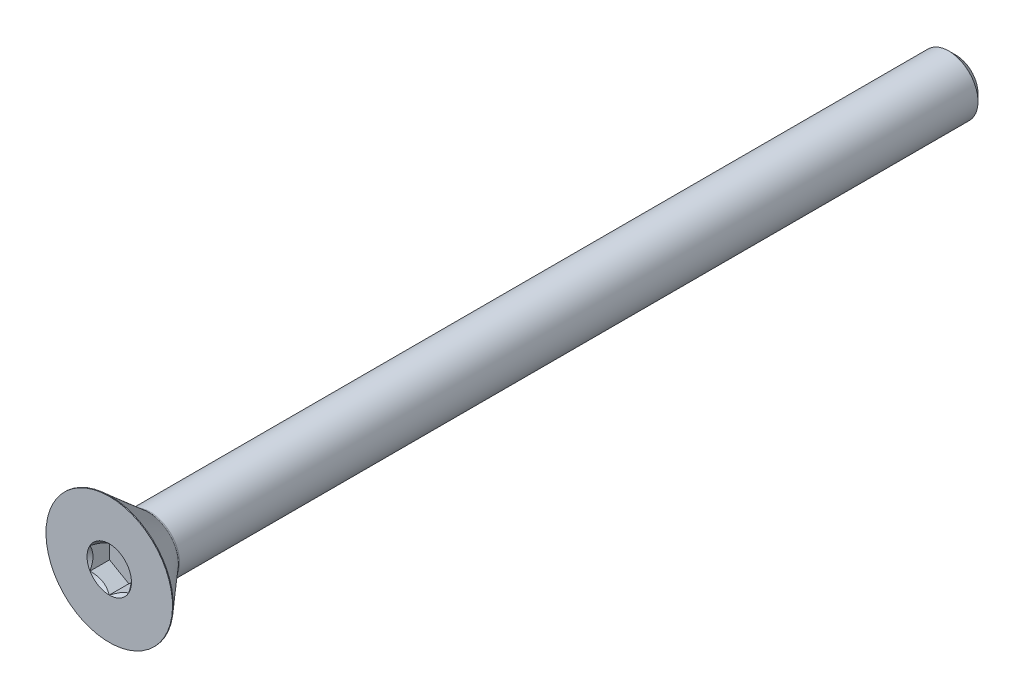
ISO-10303-21;
HEADER;
FILE_DESCRIPTION(('STEP AP214'),'2;1');
FILE_NAME('part.step','',(''),(''),'','','');
FILE_SCHEMA(('AUTOMOTIVE_DESIGN { 1 0 10303 214 1 1 1 1 }'));
ENDSEC;
DATA;
#1=APPLICATION_CONTEXT('core data for automotive mechanical design processes');
#2=APPLICATION_PROTOCOL_DEFINITION('international standard','automotive_design',2000,#1);
#3=PRODUCT_CONTEXT('',#1,'mechanical');
#4=PRODUCT('Part','Part','',(#3));
#5=PRODUCT_RELATED_PRODUCT_CATEGORY('part','',(#4));
#6=PRODUCT_DEFINITION_FORMATION('','',#4);
#7=PRODUCT_DEFINITION_CONTEXT('part definition',#1,'design');
#8=PRODUCT_DEFINITION('design','',#6,#7);
#9=PRODUCT_DEFINITION_SHAPE('','',#8);
#10=(LENGTH_UNIT() NAMED_UNIT(*) SI_UNIT(.MILLI.,.METRE.));
#11=(NAMED_UNIT(*) PLANE_ANGLE_UNIT() SI_UNIT($,.RADIAN.));
#12=(NAMED_UNIT(*) SI_UNIT($,.STERADIAN.) SOLID_ANGLE_UNIT());
#13=UNCERTAINTY_MEASURE_WITH_UNIT(LENGTH_MEASURE(1.E-05),#10,'distance_accuracy_value','');
#14=(GEOMETRIC_REPRESENTATION_CONTEXT(3) GLOBAL_UNCERTAINTY_ASSIGNED_CONTEXT((#13)) GLOBAL_UNIT_ASSIGNED_CONTEXT((#10,
#11,#12)) REPRESENTATION_CONTEXT('',''));
#15=CARTESIAN_POINT('',(0.,0.,0.));
#16=DIRECTION('',(0.,0.,1.));
#17=DIRECTION('',(1.,0.,0.));
#18=AXIS2_PLACEMENT_3D('',#15,#16,#17);
#19=CARTESIAN_POINT('',(0.,0.,34.925));
#20=DIRECTION('',(0.,0.,1.));
#21=DIRECTION('',(1.,0.,0.));
#22=AXIS2_PLACEMENT_3D('',#19,#20,#21);
#23=CONICAL_SURFACE('',#22,1.83308710467707,0.78539816339745);
#24=CARTESIAN_POINT('',(0.,0.,34.925));
#25=DIRECTION('',(0.,0.,1.));
#26=DIRECTION('',(1.,0.,0.));
#27=AXIS2_PLACEMENT_3D('',#24,#25,#26);
#28=CIRCLE('',#27,1.83308710467707);
#29=CARTESIAN_POINT('',(0.,-1.83308710467706,34.925));
#30=VERTEX_POINT('',#29);
#31=CARTESIAN_POINT('',(1.5875,-0.916543552338538,34.925));
#32=VERTEX_POINT('',#31);
#33=EDGE_CURVE('E257',#30,#32,#28,.T.);
#34=ORIENTED_EDGE('',*,*,#33,.T.);
#35=CARTESIAN_POINT('',(1.5877,-0.916428082284691,34.9251154809637));
#36=CARTESIAN_POINT('',(1.53312479190086,-0.947937093371808,34.8936308083706));
#37=CARTESIAN_POINT('',(1.47763696320971,-0.979973006203393,34.8639950460135));
#38=CARTESIAN_POINT('',(1.36449087915364,-1.04529792829092,34.8097322600208));
#39=CARTESIAN_POINT('',(1.30682185887062,-1.07859315267522,34.7851354351332));
#40=CARTESIAN_POINT('',(1.19053497812689,-1.14573141457583,34.7430003642726));
#41=CARTESIAN_POINT('',(1.13194674474407,-1.17955734689075,34.7253561927298));
#42=CARTESIAN_POINT('',(1.01348022674557,-1.24795402294714,34.698171470085));
#43=CARTESIAN_POINT('',(0.953605562983892,-1.28252267618758,34.6886106206951));
#44=CARTESIAN_POINT('',(0.850418771876555,-1.34209759781022,34.679984413104));
#45=CARTESIAN_POINT('',(0.807240015952285,-1.36702686416637,34.6787071928096));
#46=CARTESIAN_POINT('',(0.720953038535396,-1.41684467380557,34.6808570558147));
#47=CARTESIAN_POINT('',(0.67784484707861,-1.44173319974742,34.6842857885493));
#48=CARTESIAN_POINT('',(0.592046335002029,-1.49126899379091,34.6956509944333));
#49=CARTESIAN_POINT('',(0.549356408925404,-1.51591603410293,34.7035913718016));
#50=CARTESIAN_POINT('',(0.464693063478357,-1.56479643938728,34.7235484144511));
#51=CARTESIAN_POINT('',(0.422719959755073,-1.58902962212064,34.7355668292087));
#52=CARTESIAN_POINT('',(0.315211458113565,-1.65109968448354,34.7712468972472));
#53=CARTESIAN_POINT('',(0.2503427717089,-1.68855163804125,34.7975985723031));
#54=CARTESIAN_POINT('',(0.154961599380924,-1.74361998356043,34.8420835368517));
#55=CARTESIAN_POINT('',(0.123530699536157,-1.76176662204668,34.8577128578011));
#56=CARTESIAN_POINT('',(0.0612469855696365,-1.79772614107138,34.8903984878611));
#57=CARTESIAN_POINT('',(0.0303939039605758,-1.8155391760437,34.907454115657));
#58=CARTESIAN_POINT('',(-0.000200000000000447,-1.8332025747309,34.9251154809637));
#59=B_SPLINE_CURVE_WITH_KNOTS('',3,(#35,#36,#37,#38,#39,#40,#41,#42,#43,#44,#45,#46,#47,#48,#49,
#50,#51,#52,#53,#54,#55,#56,#57,#58),.UNSPECIFIED.,.F.,.F.,(4,2,2,2,2,2,2,2,2,2,2,4),(0.,
0.211482650810818,0.424197870807277,0.633533884524819,0.84234265326335,0.991755553727143,
1.14122083674205,1.29081565918877,1.44047473906438,1.6781878086972,1.79671410024894,
1.91518409436631),.UNSPECIFIED.);
#60=EDGE_CURVE('E11',#32,#30,#59,.T.);
#61=ORIENTED_EDGE('',*,*,#60,.T.);
#62=EDGE_LOOP('',(#34,#61));
#63=FACE_BOUND('',#62,.T.);
#64=ADVANCED_FACE('F39',(#63),#23,.F.);
#65=CARTESIAN_POINT('',(-1.5875,-0.916543552338528,34.925));
#66=VERTEX_POINT('',#65);
#67=EDGE_CURVE('E263',#66,#30,#28,.T.);
#68=ORIENTED_EDGE('',*,*,#67,.T.);
#69=CARTESIAN_POINT('',(0.000199999999999875,-1.8332025747309,34.9251154809637));
#70=CARTESIAN_POINT('',(-0.0543752080991366,-1.80169356364378,34.8936308083706));
#71=CARTESIAN_POINT('',(-0.10986303679029,-1.7696576508122,34.8639950460135));
#72=CARTESIAN_POINT('',(-0.223009120846359,-1.70433272872467,34.8097322600208));
#73=CARTESIAN_POINT('',(-0.280678141129382,-1.67103750434037,34.7851354351332));
#74=CARTESIAN_POINT('',(-0.396965021873105,-1.60389924243976,34.7430003642726));
#75=CARTESIAN_POINT('',(-0.455553255255934,-1.57007331012484,34.7253561927298));
#76=CARTESIAN_POINT('',(-0.574019773254434,-1.50167663406844,34.698171470085));
#77=CARTESIAN_POINT('',(-0.633894437016107,-1.467107980828,34.6886106206951));
#78=CARTESIAN_POINT('',(-0.737081228123444,-1.40753305920537,34.679984413104));
#79=CARTESIAN_POINT('',(-0.780259984047714,-1.38260379284922,34.6787071928096));
#80=CARTESIAN_POINT('',(-0.866546961464603,-1.33278598321002,34.6808570558147));
#81=CARTESIAN_POINT('',(-0.909655152921389,-1.30789745726816,34.6842857885493));
#82=CARTESIAN_POINT('',(-0.995453664997971,-1.25836166322468,34.6956509944333));
#83=CARTESIAN_POINT('',(-1.03814359107459,-1.23371462291266,34.7035913718016));
#84=CARTESIAN_POINT('',(-1.12280693652164,-1.18483421762831,34.7235484144511));
#85=CARTESIAN_POINT('',(-1.16478004024493,-1.16060103489495,34.7355668292087));
#86=CARTESIAN_POINT('',(-1.27228854188643,-1.09853097253205,34.7712468972472));
#87=CARTESIAN_POINT('',(-1.3371572282911,-1.06107901897434,34.7975985723031));
#88=CARTESIAN_POINT('',(-1.43253840061907,-1.00601067345516,34.8420835368517));
#89=CARTESIAN_POINT('',(-1.46396930046384,-0.987864034968912,34.8577128578011));
#90=CARTESIAN_POINT('',(-1.52625301443036,-0.951904515944212,34.8903984878611));
#91=CARTESIAN_POINT('',(-1.55710609603942,-0.934091480971892,34.907454115657));
#92=CARTESIAN_POINT('',(-1.5877,-0.91642808228469,34.9251154809637));
#93=B_SPLINE_CURVE_WITH_KNOTS('',3,(#69,#70,#71,#72,#73,#74,#75,#76,#77,#78,#79,#80,#81,#82,#83,
#84,#85,#86,#87,#88,#89,#90,#91,#92),.UNSPECIFIED.,.F.,.F.,(4,2,2,2,2,2,2,2,2,2,2,4),(0.,
0.211482650810817,0.424197870807278,0.633533884524818,0.84234265326335,0.991755553727143,
1.14122083674205,1.29081565918877,1.44047473906438,1.6781878086972,1.79671410024894,
1.91518409436631),.UNSPECIFIED.);
#94=EDGE_CURVE('E54',#30,#66,#93,.T.);
#95=ORIENTED_EDGE('',*,*,#94,.T.);
#96=EDGE_LOOP('',(#68,#95));
#97=FACE_BOUND('',#96,.T.);
#98=ADVANCED_FACE('F248',(#97),#23,.F.);
#99=CARTESIAN_POINT('',(-1.5875,0.916543552338534,34.925));
#100=VERTEX_POINT('',#99);
#101=EDGE_CURVE('E266',#100,#66,#28,.T.);
#102=ORIENTED_EDGE('',*,*,#101,.T.);
#103=CARTESIAN_POINT('',(-1.5875,-1.84970477544496,35.5294452553756));
#104=CARTESIAN_POINT('',(-1.5875,-1.80476240151239,35.4953462071708));
#105=CARTESIAN_POINT('',(-1.5875,-1.75957199117801,35.4615750198928));
#106=CARTESIAN_POINT('',(-1.5875,-1.66859358881314,35.3948243913548));
#107=CARTESIAN_POINT('',(-1.5875,-1.62280545181692,35.3618451478851));
#108=CARTESIAN_POINT('',(-1.5875,-1.48372199901346,35.2638287251651));
#109=CARTESIAN_POINT('',(-1.5875,-1.38939051274161,35.2002376365292));
#110=CARTESIAN_POINT('',(-1.5875,-1.1914395580246,35.0751998751445));
#111=CARTESIAN_POINT('',(-1.5875,-1.08759987522282,35.0140979424035));
#112=CARTESIAN_POINT('',(-1.5875,-0.874706489386586,34.9021896537273));
#113=CARTESIAN_POINT('',(-1.5875,-0.765671975902254,34.8513485632185));
#114=CARTESIAN_POINT('',(-1.5875,-0.602217292000084,34.7891427739001));
#115=CARTESIAN_POINT('',(-1.5875,-0.550263299202901,34.7713261951995));
#116=CARTESIAN_POINT('',(-1.5875,-0.445082037721644,34.7398615140692));
#117=CARTESIAN_POINT('',(-1.5875,-0.391854683409843,34.7262136928237));
#118=CARTESIAN_POINT('',(-1.5875,-0.285344657080773,34.7040290273729));
#119=CARTESIAN_POINT('',(-1.5875,-0.232080800210171,34.6954032745585));
#120=CARTESIAN_POINT('',(-1.5875,-0.124959456415258,34.6834346825164));
#121=CARTESIAN_POINT('',(-1.5875,-0.0711020784671772,34.6800908892227));
#122=CARTESIAN_POINT('',(-1.5875,0.0346213127870743,34.6789438271109));
#123=CARTESIAN_POINT('',(-1.5875,0.0864851538798625,34.6809346608082));
#124=CARTESIAN_POINT('',(-1.5875,0.189778917943217,34.6898876527514));
#125=CARTESIAN_POINT('',(-1.5875,0.241208798942216,34.6968502864056));
#126=CARTESIAN_POINT('',(-1.5875,0.344133383886251,34.7154812853777));
#127=CARTESIAN_POINT('',(-1.5875,0.395613227208264,34.7272304949867));
#128=CARTESIAN_POINT('',(-1.5875,0.497445238808223,34.7548036611325));
#129=CARTESIAN_POINT('',(-1.5875,0.547797493505246,34.7706273042326));
#130=CARTESIAN_POINT('',(-1.5875,0.705347074888855,34.8261176410875));
#131=CARTESIAN_POINT('',(-1.5875,0.810327219424594,34.8720631846965));
#132=CARTESIAN_POINT('',(-1.5875,1.01536433721947,34.9742446076069));
#133=CARTESIAN_POINT('',(-1.5875,1.11540204185221,35.0305172602773));
#134=CARTESIAN_POINT('',(-1.5875,1.30660224236786,35.1466420088267));
#135=CARTESIAN_POINT('',(-1.5875,1.39795887507229,35.2061784333227));
#136=CARTESIAN_POINT('',(-1.5875,1.53255412415748,35.2982282143955));
#137=CARTESIAN_POINT('',(-1.5875,1.57683885315436,35.3292385020962));
#138=CARTESIAN_POINT('',(-1.5875,1.66480239811796,35.3920825224737));
#139=CARTESIAN_POINT('',(-1.5875,1.70848137749647,35.4239160261633));
#140=CARTESIAN_POINT('',(-1.5875,1.75190803967259,35.4560909828344));
#141=B_SPLINE_CURVE_WITH_KNOTS('',3,(#103,#104,#105,#106,#107,#108,#109,#110,#111,#112,#113,
#114,#115,#116,#117,#118,#119,#120,#121,#122,#123,#124,#125,#126,#127,#128,#129,#130,#131,#132,
#133,#134,#135,#136,#137,#138,#139,#140),.UNSPECIFIED.,.F.,.F.,(4,2,2,2,2,2,2,2,2,2,2,2,2,2,2,2,
2,2,4),(0.,0.16923836493243,0.338518567064947,0.679661123808209,1.04081978780735,
1.40073457216112,1.56536778601317,1.73001210198752,1.89164527462954,2.0532492485751,
2.2087065856554,2.36417878970806,2.52239358424591,2.68059621131738,3.0233722729095,
3.36739346781148,3.69436280662924,3.85654464660763,4.01868184900242),.UNSPECIFIED.);
#142=EDGE_CURVE('E221',#66,#100,#141,.T.);
#143=ORIENTED_EDGE('',*,*,#142,.T.);
#144=EDGE_LOOP('',(#102,#143));
#145=FACE_BOUND('',#144,.T.);
#146=ADVANCED_FACE('F253',(#145),#23,.F.);
#147=CARTESIAN_POINT('',(0.,1.83308710467707,34.925));
#148=VERTEX_POINT('',#147);
#149=EDGE_CURVE('E158',#148,#100,#28,.T.);
#150=ORIENTED_EDGE('',*,*,#149,.T.);
#151=CARTESIAN_POINT('',(-1.5877,0.916428082284696,34.9251154809637));
#152=CARTESIAN_POINT('',(-1.53312479190087,0.947937093371812,34.8936308083706));
#153=CARTESIAN_POINT('',(-1.47763696320971,0.979973006203397,34.8639950460135));
#154=CARTESIAN_POINT('',(-1.36449087915364,1.04529792829092,34.8097322600208));
#155=CARTESIAN_POINT('',(-1.30682185887062,1.07859315267523,34.7851354351332));
#156=CARTESIAN_POINT('',(-1.1905349781269,1.14573141457584,34.7430003642726));
#157=CARTESIAN_POINT('',(-1.13194674474407,1.17955734689076,34.7253561927298));
#158=CARTESIAN_POINT('',(-1.01348022674557,1.24795402294715,34.698171470085));
#159=CARTESIAN_POINT('',(-0.953605562983895,1.28252267618759,34.6886106206951));
#160=CARTESIAN_POINT('',(-0.850418771876558,1.34209759781022,34.679984413104));
#161=CARTESIAN_POINT('',(-0.807240015952288,1.36702686416637,34.6787071928096));
#162=CARTESIAN_POINT('',(-0.720953038535399,1.41684467380557,34.6808570558147));
#163=CARTESIAN_POINT('',(-0.677844847078612,1.44173319974743,34.6842857885493));
#164=CARTESIAN_POINT('',(-0.59204633500203,1.49126899379091,34.6956509944333));
#165=CARTESIAN_POINT('',(-0.549356408925406,1.51591603410294,34.7035913718016));
#166=CARTESIAN_POINT('',(-0.464693063478358,1.56479643938728,34.7235484144511));
#167=CARTESIAN_POINT('',(-0.422719959755074,1.58902962212065,34.7355668292087));
#168=CARTESIAN_POINT('',(-0.315211458113565,1.65109968448354,34.7712468972472));
#169=CARTESIAN_POINT('',(-0.250342771708898,1.68855163804126,34.7975985723031));
#170=CARTESIAN_POINT('',(-0.154961599380922,1.74361998356043,34.8420835368517));
#171=CARTESIAN_POINT('',(-0.123530699536156,1.76176662204668,34.8577128578011));
#172=CARTESIAN_POINT('',(-0.0612469855696361,1.79772614107138,34.8903984878611));
#173=CARTESIAN_POINT('',(-0.0303939039605752,1.8155391760437,34.907454115657));
#174=CARTESIAN_POINT('',(0.000200000000001833,1.8332025747309,34.9251154809637));
#175=B_SPLINE_CURVE_WITH_KNOTS('',3,(#151,#152,#153,#154,#155,#156,#157,#158,#159,#160,#161,
#162,#163,#164,#165,#166,#167,#168,#169,#170,#171,#172,#173,#174),.UNSPECIFIED.,.F.,.F.,(4,2,2,
2,2,2,2,2,2,2,2,4),(0.,0.211482650810815,0.424197870807277,0.633533884524818,0.84234265326335,
0.991755553727143,1.14122083674205,1.29081565918877,1.44047473906438,1.67818780869721,
1.79671410024894,1.91518409436632),.UNSPECIFIED.);
#176=EDGE_CURVE('E111',#100,#148,#175,.T.);
#177=ORIENTED_EDGE('',*,*,#176,.T.);
#178=EDGE_LOOP('',(#150,#177));
#179=FACE_BOUND('',#178,.T.);
#180=ADVANCED_FACE('F283',(#179),#23,.F.);
#181=CARTESIAN_POINT('',(1.5875,0.916543552338535,34.925));
#182=VERTEX_POINT('',#181);
#183=EDGE_CURVE('E153',#182,#148,#28,.T.);
#184=ORIENTED_EDGE('',*,*,#183,.T.);
#185=CARTESIAN_POINT('',(-0.000200000000000206,1.8332025747309,34.9251154809637));
#186=CARTESIAN_POINT('',(0.0543752080991354,1.80169356364379,34.8936308083706));
#187=CARTESIAN_POINT('',(0.109863036790289,1.7696576508122,34.8639950460135));
#188=CARTESIAN_POINT('',(0.223009120846358,1.70433272872468,34.8097322600208));
#189=CARTESIAN_POINT('',(0.280678141129381,1.67103750434037,34.7851354351332));
#190=CARTESIAN_POINT('',(0.396965021873104,1.60389924243976,34.7430003642726));
#191=CARTESIAN_POINT('',(0.455553255255932,1.57007331012484,34.7253561927298));
#192=CARTESIAN_POINT('',(0.574019773254432,1.50167663406845,34.698171470085));
#193=CARTESIAN_POINT('',(0.633894437016106,1.46710798082801,34.6886106206951));
#194=CARTESIAN_POINT('',(0.737081228123443,1.40753305920538,34.679984413104));
#195=CARTESIAN_POINT('',(0.780259984047713,1.38260379284922,34.6787071928096));
#196=CARTESIAN_POINT('',(0.866546961464603,1.33278598321002,34.6808570558147));
#197=CARTESIAN_POINT('',(0.90965515292139,1.30789745726817,34.6842857885493));
#198=CARTESIAN_POINT('',(0.995453664997971,1.25836166322469,34.6956509944333));
#199=CARTESIAN_POINT('',(1.0381435910746,1.23371462291266,34.7035913718016));
#200=CARTESIAN_POINT('',(1.12280693652164,1.18483421762832,34.7235484144511));
#201=CARTESIAN_POINT('',(1.16478004024493,1.16060103489495,34.7355668292087));
#202=CARTESIAN_POINT('',(1.27228854188644,1.09853097253206,34.7712468972472));
#203=CARTESIAN_POINT('',(1.3371572282911,1.06107901897434,34.7975985723031));
#204=CARTESIAN_POINT('',(1.43253840061908,1.00601067345516,34.8420835368517));
#205=CARTESIAN_POINT('',(1.46396930046385,0.987864034968916,34.8577128578011));
#206=CARTESIAN_POINT('',(1.52625301443037,0.951904515944216,34.8903984878611));
#207=CARTESIAN_POINT('',(1.55710609603943,0.934091480971896,34.907454115657));
#208=CARTESIAN_POINT('',(1.5877,0.916428082284696,34.9251154809637));
#209=B_SPLINE_CURVE_WITH_KNOTS('',3,(#185,#186,#187,#188,#189,#190,#191,#192,#193,#194,#195,
#196,#197,#198,#199,#200,#201,#202,#203,#204,#205,#206,#207,#208),.UNSPECIFIED.,.F.,.F.,(4,2,2,
2,2,2,2,2,2,2,2,4),(0.,0.211482650810816,0.424197870807277,0.633533884524818,0.84234265326335,
0.991755553727144,1.14122083674205,1.29081565918878,1.44047473906438,1.6781878086972,
1.79671410024894,1.91518409436631),.UNSPECIFIED.);
#210=EDGE_CURVE('E191',#148,#182,#209,.T.);
#211=ORIENTED_EDGE('',*,*,#210,.T.);
#212=EDGE_LOOP('',(#184,#211));
#213=FACE_BOUND('',#212,.T.);
#214=ADVANCED_FACE('F208',(#213),#23,.F.);
#215=CARTESIAN_POINT('',(0.,0.,-34.925));
#216=DIRECTION('',(0.,0.,-1.));
#217=DIRECTION('',(0.,1.,0.));
#218=AXIS2_PLACEMENT_3D('',#215,#216,#217);
#219=CYLINDRICAL_SURFACE('',#218,5.21970000000001);
#220=CARTESIAN_POINT('',(0.,0.,34.925));
#221=DIRECTION('',(0.,0.,-1.));
#222=DIRECTION('',(0.,1.,0.));
#223=AXIS2_PLACEMENT_3D('',#220,#221,#222);
#224=CIRCLE('',#223,5.21970000000001);
#225=CARTESIAN_POINT('',(0.,5.2197,34.925));
#226=VERTEX_POINT('',#225);
#227=EDGE_CURVE('E178',#226,#226,#224,.T.);
#228=ORIENTED_EDGE('',*,*,#227,.T.);
#229=EDGE_LOOP('',(#228));
#230=FACE_BOUND('',#229,.T.);
#231=CARTESIAN_POINT('',(0.,0.,34.860484));
#232=DIRECTION('',(0.,0.,-1.));
#233=DIRECTION('',(0.,1.,0.));
#234=AXIS2_PLACEMENT_3D('',#231,#232,#233);
#235=CIRCLE('',#234,5.21970000000001);
#236=CARTESIAN_POINT('',(0.,5.2197,34.860484));
#237=VERTEX_POINT('',#236);
#238=EDGE_CURVE('E157',#237,#237,#235,.T.);
#239=ORIENTED_EDGE('',*,*,#238,.F.);
#240=EDGE_LOOP('',(#239));
#241=FACE_BOUND('',#240,.T.);
#242=ADVANCED_FACE('F41',(#230,#241),#219,.T.);
#243=CARTESIAN_POINT('',(0.,0.,34.925));
#244=DIRECTION('',(0.,0.,1.));
#245=DIRECTION('',(0.,-1.,0.));
#246=AXIS2_PLACEMENT_3D('',#243,#244,#245);
#247=PLANE('',#246);
#248=ORIENTED_EDGE('',*,*,#183,.F.);
#249=EDGE_CURVE('E142',#32,#182,#28,.T.);
#250=ORIENTED_EDGE('',*,*,#249,.F.);
#251=ORIENTED_EDGE('',*,*,#33,.F.);
#252=ORIENTED_EDGE('',*,*,#67,.F.);
#253=ORIENTED_EDGE('',*,*,#101,.F.);
#254=ORIENTED_EDGE('',*,*,#149,.F.);
#255=EDGE_LOOP('',(#248,#250,#251,#252,#253,#254));
#256=FACE_BOUND('',#255,.T.);
#257=ORIENTED_EDGE('',*,*,#227,.F.);
#258=EDGE_LOOP('',(#257));
#259=FACE_BOUND('',#258,.T.);
#260=ADVANCED_FACE('F270',(#256,#259),#247,.T.);
#261=CARTESIAN_POINT('',(0.,1.81768750000001,-34.925));
#262=DIRECTION('',(0.,0.,-1.));
#263=DIRECTION('',(0.,1.,0.));
#264=AXIS2_PLACEMENT_3D('',#261,#262,#263);
#265=PLANE('',#264);
#266=CARTESIAN_POINT('',(0.,0.,-34.925));
#267=DIRECTION('',(0.,0.,-1.));
#268=DIRECTION('',(0.,1.,0.));
#269=AXIS2_PLACEMENT_3D('',#266,#267,#268);
#270=CIRCLE('',#269,1.81768750000002);
#271=CARTESIAN_POINT('',(0.,1.81768750000001,-34.925));
#272=VERTEX_POINT('',#271);
#273=EDGE_CURVE('E174',#272,#272,#270,.T.);
#274=ORIENTED_EDGE('',*,*,#273,.T.);
#275=EDGE_LOOP('',(#274));
#276=FACE_BOUND('',#275,.T.);
#277=ADVANCED_FACE('F339',(#276),#265,.T.);
#278=CARTESIAN_POINT('',(0.,0.,-34.925));
#279=DIRECTION('',(0.,0.,1.));
#280=DIRECTION('',(0.,-1.,0.));
#281=AXIS2_PLACEMENT_3D('',#278,#279,#280);
#282=CONICAL_SURFACE('',#281,1.81768750000002,0.785398163397453);
#283=CARTESIAN_POINT('',(0.,0.,-34.3296875));
#284=DIRECTION('',(0.,0.,-1.));
#285=DIRECTION('',(0.,1.,0.));
#286=AXIS2_PLACEMENT_3D('',#283,#284,#285);
#287=CIRCLE('',#286,2.41300000000003);
#288=CARTESIAN_POINT('',(0.,2.41300000000002,-34.3296875));
#289=VERTEX_POINT('',#288);
#290=EDGE_CURVE('E170',#289,#289,#287,.T.);
#291=ORIENTED_EDGE('',*,*,#290,.T.);
#292=EDGE_LOOP('',(#291));
#293=FACE_BOUND('',#292,.T.);
#294=ORIENTED_EDGE('',*,*,#273,.F.);
#295=EDGE_LOOP('',(#294));
#296=FACE_BOUND('',#295,.T.);
#297=ADVANCED_FACE('F329',(#293,#296),#282,.T.);
#298=CARTESIAN_POINT('',(0.,0.,-34.925));
#299=DIRECTION('',(0.,0.,-1.));
#300=DIRECTION('',(0.,1.,0.));
#301=AXIS2_PLACEMENT_3D('',#298,#299,#300);
#302=CYLINDRICAL_SURFACE('',#301,2.41300000000002);
#303=CARTESIAN_POINT('',(0.,0.,31.5423662286613));
#304=DIRECTION('',(0.,0.,-1.));
#305=DIRECTION('',(0.,1.,0.));
#306=AXIS2_PLACEMENT_3D('',#303,#304,#305);
#307=CIRCLE('',#306,2.413);
#308=CARTESIAN_POINT('',(0.,2.41299999999999,31.5423662286613));
#309=VERTEX_POINT('',#308);
#310=EDGE_CURVE('E166',#309,#309,#307,.T.);
#311=ORIENTED_EDGE('',*,*,#310,.T.);
#312=EDGE_LOOP('',(#311));
#313=FACE_BOUND('',#312,.T.);
#314=ORIENTED_EDGE('',*,*,#290,.F.);
#315=EDGE_LOOP('',(#314));
#316=FACE_BOUND('',#315,.T.);
#317=ADVANCED_FACE('F320',(#313,#316),#302,.T.);
#318=CARTESIAN_POINT('',(0.,0.,31.5423662286613));
#319=DIRECTION('',(0.,0.,-1.));
#320=DIRECTION('',(0.,1.,0.));
#321=AXIS2_PLACEMENT_3D('',#318,#319,#320);
#322=TOROIDAL_SURFACE('',#321,2.65205436006274,0.239054360062735);
#323=CARTESIAN_POINT('',(0.,0.,31.6992));
#324=DIRECTION('',(0.,0.,-1.));
#325=DIRECTION('',(0.,1.,0.));
#326=AXIS2_PLACEMENT_3D('',#323,#324,#325);
#327=CIRCLE('',#326,2.47163774432937);
#328=CARTESIAN_POINT('',(0.,2.47163774432936,31.6992));
#329=VERTEX_POINT('',#328);
#330=EDGE_CURVE('E162',#329,#329,#327,.T.);
#331=ORIENTED_EDGE('',*,*,#330,.T.);
#332=EDGE_LOOP('',(#331));
#333=FACE_BOUND('',#332,.T.);
#334=ORIENTED_EDGE('',*,*,#310,.F.);
#335=EDGE_LOOP('',(#334));
#336=FACE_BOUND('',#335,.T.);
#337=ADVANCED_FACE('F310',(#333,#336),#322,.F.);
#338=CARTESIAN_POINT('',(0.,0.,31.6992));
#339=DIRECTION('',(0.,0.,1.));
#340=DIRECTION('',(0.,-1.,0.));
#341=AXIS2_PLACEMENT_3D('',#338,#339,#340);
#342=CONICAL_SURFACE('',#341,2.47163774432937,0.715584993317677);
#343=ORIENTED_EDGE('',*,*,#238,.T.);
#344=EDGE_LOOP('',(#343));
#345=FACE_BOUND('',#344,.T.);
#346=ORIENTED_EDGE('',*,*,#330,.F.);
#347=EDGE_LOOP('',(#346));
#348=FACE_BOUND('',#347,.T.);
#349=ADVANCED_FACE('F206',(#345,#348),#342,.T.);
#350=ORIENTED_EDGE('',*,*,#249,.T.);
#351=CARTESIAN_POINT('',(1.5875,-1.84970477544497,35.5294452553756));
#352=CARTESIAN_POINT('',(1.5875,-1.80476240151239,35.4953462071708));
#353=CARTESIAN_POINT('',(1.5875,-1.75957199117801,35.4615750198928));
#354=CARTESIAN_POINT('',(1.5875,-1.66859358881314,35.3948243913548));
#355=CARTESIAN_POINT('',(1.5875,-1.62280545181692,35.3618451478851));
#356=CARTESIAN_POINT('',(1.5875,-1.48372199901346,35.2638287251651));
#357=CARTESIAN_POINT('',(1.5875,-1.38939051274161,35.2002376365292));
#358=CARTESIAN_POINT('',(1.5875,-1.1914395580246,35.0751998751445));
#359=CARTESIAN_POINT('',(1.5875,-1.08759987522282,35.0140979424035));
#360=CARTESIAN_POINT('',(1.5875,-0.874706489386586,34.9021896537273));
#361=CARTESIAN_POINT('',(1.5875,-0.765671975902254,34.8513485632185));
#362=CARTESIAN_POINT('',(1.5875,-0.602217292000085,34.7891427739001));
#363=CARTESIAN_POINT('',(1.5875,-0.550263299202902,34.7713261951995));
#364=CARTESIAN_POINT('',(1.5875,-0.445082037721645,34.7398615140692));
#365=CARTESIAN_POINT('',(1.5875,-0.391854683409844,34.7262136928237));
#366=CARTESIAN_POINT('',(1.5875,-0.285344657080773,34.7040290273729));
#367=CARTESIAN_POINT('',(1.5875,-0.232080800210171,34.6954032745585));
#368=CARTESIAN_POINT('',(1.5875,-0.124959456415258,34.6834346825164));
#369=CARTESIAN_POINT('',(1.5875,-0.0711020784671775,34.6800908892227));
#370=CARTESIAN_POINT('',(1.5875,0.0346213127870741,34.6789438271109));
#371=CARTESIAN_POINT('',(1.5875,0.0864851538798625,34.6809346608082));
#372=CARTESIAN_POINT('',(1.5875,0.189778917943217,34.6898876527514));
#373=CARTESIAN_POINT('',(1.5875,0.241208798942217,34.6968502864056));
#374=CARTESIAN_POINT('',(1.5875,0.344133383886252,34.7154812853777));
#375=CARTESIAN_POINT('',(1.5875,0.395613227208265,34.7272304949867));
#376=CARTESIAN_POINT('',(1.5875,0.497445238808223,34.7548036611325));
#377=CARTESIAN_POINT('',(1.5875,0.547797493505246,34.7706273042326));
#378=CARTESIAN_POINT('',(1.5875,0.705347074888855,34.8261176410875));
#379=CARTESIAN_POINT('',(1.5875,0.810327219424594,34.8720631846965));
#380=CARTESIAN_POINT('',(1.5875,1.01536433721947,34.9742446076069));
#381=CARTESIAN_POINT('',(1.5875,1.11540204185221,35.0305172602773));
#382=CARTESIAN_POINT('',(1.5875,1.30660224236786,35.1466420088267));
#383=CARTESIAN_POINT('',(1.5875,1.39795887507229,35.2061784333227));
#384=CARTESIAN_POINT('',(1.5875,1.53255412415748,35.2982282143955));
#385=CARTESIAN_POINT('',(1.5875,1.57683885315436,35.3292385020962));
#386=CARTESIAN_POINT('',(1.5875,1.66480239811796,35.3920825224737));
#387=CARTESIAN_POINT('',(1.5875,1.70848137749647,35.4239160261633));
#388=CARTESIAN_POINT('',(1.5875,1.75190803967259,35.4560909828344));
#389=B_SPLINE_CURVE_WITH_KNOTS('',3,(#351,#352,#353,#354,#355,#356,#357,#358,#359,#360,#361,
#362,#363,#364,#365,#366,#367,#368,#369,#370,#371,#372,#373,#374,#375,#376,#377,#378,#379,#380,
#381,#382,#383,#384,#385,#386,#387,#388),.UNSPECIFIED.,.F.,.F.,(4,2,2,2,2,2,2,2,2,2,2,2,2,2,2,2,
2,2,4),(0.,0.169238364932431,0.338518567064948,0.67966112380821,1.04081978780735,
1.40073457216112,1.56536778601317,1.73001210198752,1.89164527462954,2.0532492485751,
2.2087065856554,2.36417878970806,2.52239358424591,2.68059621131738,3.0233722729095,
3.36739346781148,3.69436280662924,3.85654464660763,4.01868184900242),.UNSPECIFIED.);
#390=EDGE_CURVE('E182',#182,#32,#389,.F.);
#391=ORIENTED_EDGE('',*,*,#390,.T.);
#392=EDGE_LOOP('',(#350,#391));
#393=FACE_BOUND('',#392,.T.);
#394=ADVANCED_FACE('F200',(#393),#23,.F.);
#395=CARTESIAN_POINT('',(0.,-1.83308710467706,33.3121));
#396=DIRECTION('',(0.5,-0.866025403784439,0.));
#397=DIRECTION('',(0.866025403784439,0.5,0.));
#398=AXIS2_PLACEMENT_3D('',#395,#396,#397);
#399=PLANE('',#398);
#400=DIRECTION('',(0.,0.,1.));
#401=VECTOR('',#400,1.);
#402=CARTESIAN_POINT('',(1.5875,-0.916543552338529,33.3121));
#403=LINE('',#402,#401);
#404=CARTESIAN_POINT('',(1.5875,-0.916543552338529,33.3121));
#405=VERTEX_POINT('',#404);
#406=EDGE_CURVE('E61',#405,#32,#403,.T.);
#407=ORIENTED_EDGE('',*,*,#406,.F.);
#408=DIRECTION('',(0.866025403784439,0.5,0.));
#409=VECTOR('',#408,1.);
#410=CARTESIAN_POINT('',(0.,-1.83308710467706,33.3121));
#411=LINE('',#410,#409);
#412=CARTESIAN_POINT('',(0.,-1.83308710467706,33.3121));
#413=VERTEX_POINT('',#412);
#414=EDGE_CURVE('E441',#413,#405,#411,.T.);
#415=ORIENTED_EDGE('',*,*,#414,.F.);
#416=DIRECTION('',(0.,0.,1.));
#417=VECTOR('',#416,1.);
#418=CARTESIAN_POINT('',(0.,-1.83308710467706,33.3121));
#419=LINE('',#418,#417);
#420=EDGE_CURVE('E70',#413,#30,#419,.T.);
#421=ORIENTED_EDGE('',*,*,#420,.T.);
#422=ORIENTED_EDGE('',*,*,#60,.F.);
#423=EDGE_LOOP('',(#407,#415,#421,#422));
#424=FACE_BOUND('',#423,.T.);
#425=ADVANCED_FACE('F205',(#424),#399,.F.);
#426=CARTESIAN_POINT('',(-1.5875,-0.916543552338528,33.3121));
#427=DIRECTION('',(-0.5,-0.866025403784439,0.));
#428=DIRECTION('',(0.866025403784439,-0.5,0.));
#429=AXIS2_PLACEMENT_3D('',#426,#427,#428);
#430=PLANE('',#429);
#431=ORIENTED_EDGE('',*,*,#420,.F.);
#432=DIRECTION('',(0.866025403784438,-0.5,0.));
#433=VECTOR('',#432,1.);
#434=CARTESIAN_POINT('',(-1.5875,-0.916543552338528,33.3121));
#435=LINE('',#434,#433);
#436=CARTESIAN_POINT('',(-1.5875,-0.916543552338528,33.3121));
#437=VERTEX_POINT('',#436);
#438=EDGE_CURVE('E124',#437,#413,#435,.T.);
#439=ORIENTED_EDGE('',*,*,#438,.F.);
#440=DIRECTION('',(0.,0.,1.));
#441=VECTOR('',#440,1.);
#442=CARTESIAN_POINT('',(-1.5875,-0.916543552338528,33.3121));
#443=LINE('',#442,#441);
#444=EDGE_CURVE('E115',#437,#66,#443,.T.);
#445=ORIENTED_EDGE('',*,*,#444,.T.);
#446=ORIENTED_EDGE('',*,*,#94,.F.);
#447=EDGE_LOOP('',(#431,#439,#445,#446));
#448=FACE_BOUND('',#447,.T.);
#449=ADVANCED_FACE('F233',(#448),#430,.F.);
#450=CARTESIAN_POINT('',(-1.5875,0.916543552338534,33.3121));
#451=DIRECTION('',(-1.,0.,0.));
#452=DIRECTION('',(0.,0.,1.));
#453=AXIS2_PLACEMENT_3D('',#450,#451,#452);
#454=PLANE('',#453);
#455=ORIENTED_EDGE('',*,*,#444,.F.);
#456=DIRECTION('',(0.,-1.,0.));
#457=VECTOR('',#456,1.);
#458=CARTESIAN_POINT('',(-1.5875,0.916543552338534,33.3121));
#459=LINE('',#458,#457);
#460=CARTESIAN_POINT('',(-1.5875,0.916543552338534,33.3121));
#461=VERTEX_POINT('',#460);
#462=EDGE_CURVE('E119',#461,#437,#459,.T.);
#463=ORIENTED_EDGE('',*,*,#462,.F.);
#464=DIRECTION('',(0.,0.,1.));
#465=VECTOR('',#464,1.);
#466=CARTESIAN_POINT('',(-1.5875,0.916543552338534,33.3121));
#467=LINE('',#466,#465);
#468=EDGE_CURVE('E103',#461,#100,#467,.T.);
#469=ORIENTED_EDGE('',*,*,#468,.T.);
#470=ORIENTED_EDGE('',*,*,#142,.F.);
#471=EDGE_LOOP('',(#455,#463,#469,#470));
#472=FACE_BOUND('',#471,.T.);
#473=ADVANCED_FACE('F120',(#472),#454,.F.);
#474=CARTESIAN_POINT('',(0.,1.83308710467707,33.3121));
#475=DIRECTION('',(-0.5,0.866025403784439,0.));
#476=DIRECTION('',(-0.866025403784439,-0.5,0.));
#477=AXIS2_PLACEMENT_3D('',#474,#475,#476);
#478=PLANE('',#477);
#479=ORIENTED_EDGE('',*,*,#468,.F.);
#480=DIRECTION('',(-0.866025403784439,-0.5,0.));
#481=VECTOR('',#480,1.);
#482=CARTESIAN_POINT('',(0.,1.83308710467707,33.3121));
#483=LINE('',#482,#481);
#484=CARTESIAN_POINT('',(0.,1.83308710467707,33.3121));
#485=VERTEX_POINT('',#484);
#486=EDGE_CURVE('E108',#485,#461,#483,.T.);
#487=ORIENTED_EDGE('',*,*,#486,.F.);
#488=DIRECTION('',(0.,0.,1.));
#489=VECTOR('',#488,1.);
#490=CARTESIAN_POINT('',(0.,1.83308710467707,33.3121));
#491=LINE('',#490,#489);
#492=EDGE_CURVE('E116',#485,#148,#491,.T.);
#493=ORIENTED_EDGE('',*,*,#492,.T.);
#494=ORIENTED_EDGE('',*,*,#176,.F.);
#495=EDGE_LOOP('',(#479,#487,#493,#494));
#496=FACE_BOUND('',#495,.T.);
#497=ADVANCED_FACE('F105',(#496),#478,.F.);
#498=CARTESIAN_POINT('',(1.5875,0.916543552338535,33.3121));
#499=DIRECTION('',(0.5,0.866025403784439,0.));
#500=DIRECTION('',(-0.866025403784439,0.5,0.));
#501=AXIS2_PLACEMENT_3D('',#498,#499,#500);
#502=PLANE('',#501);
#503=ORIENTED_EDGE('',*,*,#492,.F.);
#504=DIRECTION('',(-0.866025403784439,0.5,0.));
#505=VECTOR('',#504,1.);
#506=CARTESIAN_POINT('',(1.5875,0.916543552338535,33.3121));
#507=LINE('',#506,#505);
#508=CARTESIAN_POINT('',(1.5875,0.916543552338535,33.3121));
#509=VERTEX_POINT('',#508);
#510=EDGE_CURVE('E130',#509,#485,#507,.T.);
#511=ORIENTED_EDGE('',*,*,#510,.F.);
#512=DIRECTION('',(0.,0.,1.));
#513=VECTOR('',#512,1.);
#514=CARTESIAN_POINT('',(1.5875,0.916543552338535,33.3121));
#515=LINE('',#514,#513);
#516=EDGE_CURVE('E147',#509,#182,#515,.T.);
#517=ORIENTED_EDGE('',*,*,#516,.T.);
#518=ORIENTED_EDGE('',*,*,#210,.F.);
#519=EDGE_LOOP('',(#503,#511,#517,#518));
#520=FACE_BOUND('',#519,.T.);
#521=ADVANCED_FACE('F240',(#520),#502,.F.);
#522=CARTESIAN_POINT('',(1.5875,-0.916543552338529,33.3121));
#523=DIRECTION('',(1.,0.,0.));
#524=DIRECTION('',(0.,0.,-1.));
#525=AXIS2_PLACEMENT_3D('',#522,#523,#524);
#526=PLANE('',#525);
#527=ORIENTED_EDGE('',*,*,#516,.F.);
#528=DIRECTION('',(0.,1.,0.));
#529=VECTOR('',#528,1.);
#530=CARTESIAN_POINT('',(1.5875,-0.916543552338529,33.3121));
#531=LINE('',#530,#529);
#532=EDGE_CURVE('E134',#405,#509,#531,.T.);
#533=ORIENTED_EDGE('',*,*,#532,.F.);
#534=ORIENTED_EDGE('',*,*,#406,.T.);
#535=ORIENTED_EDGE('',*,*,#390,.F.);
#536=EDGE_LOOP('',(#527,#533,#534,#535));
#537=FACE_BOUND('',#536,.T.);
#538=ADVANCED_FACE('F198',(#537),#526,.F.);
#539=CARTESIAN_POINT('',(0.,0.,33.3121));
#540=DIRECTION('',(0.,0.,1.));
#541=DIRECTION('',(1.,0.,0.));
#542=AXIS2_PLACEMENT_3D('',#539,#540,#541);
#543=PLANE('',#542);
#544=ORIENTED_EDGE('',*,*,#414,.T.);
#545=ORIENTED_EDGE('',*,*,#532,.T.);
#546=ORIENTED_EDGE('',*,*,#510,.T.);
#547=ORIENTED_EDGE('',*,*,#486,.T.);
#548=ORIENTED_EDGE('',*,*,#462,.T.);
#549=ORIENTED_EDGE('',*,*,#438,.T.);
#550=EDGE_LOOP('',(#544,#545,#546,#547,#548,#549));
#551=FACE_BOUND('',#550,.T.);
#552=ADVANCED_FACE('F127',(#551),#543,.T.);
#553=CLOSED_SHELL('',(#64,#98,#146,#180,#214,#242,#260,#277,#297,#317,#337,#349,#394,#425,#449,
#473,#497,#521,#538,#552));
#554=MANIFOLD_SOLID_BREP('B2',#553);
#555=ADVANCED_BREP_SHAPE_REPRESENTATION('',(#18,#554),#14);
#556=SHAPE_DEFINITION_REPRESENTATION(#9,#555);
ENDSEC;
END-ISO-10303-21;
